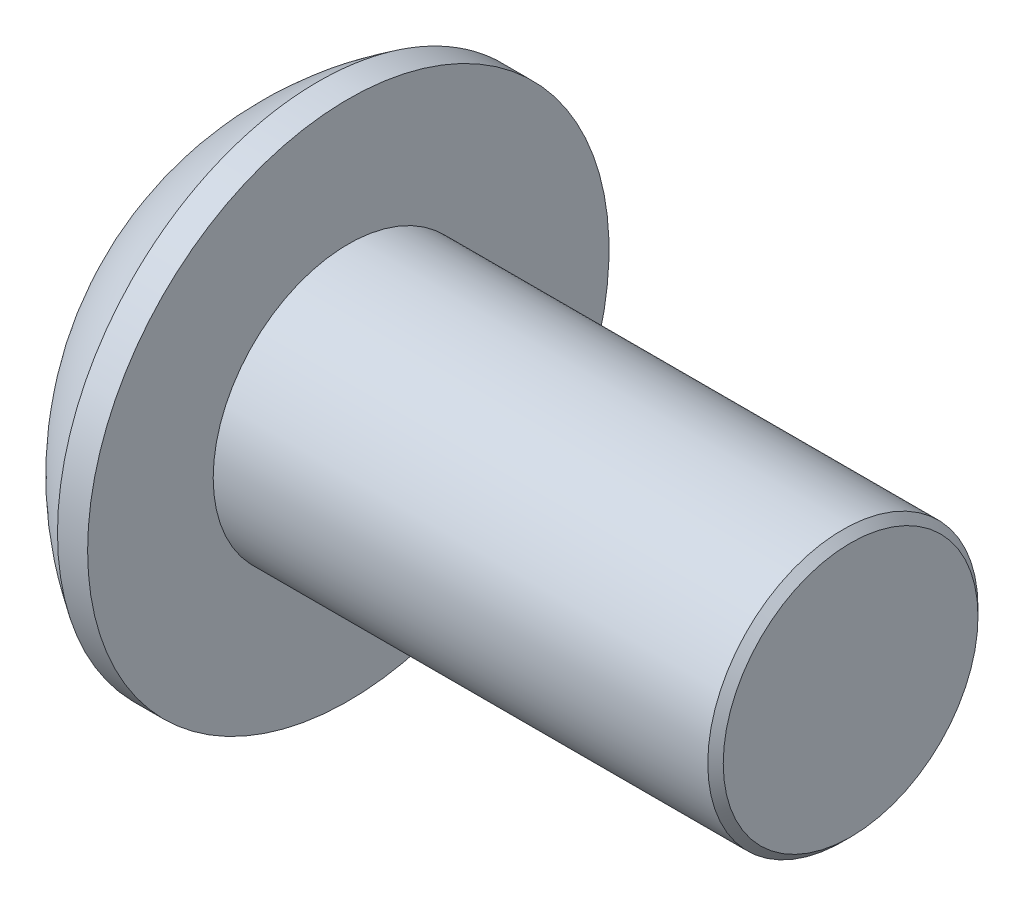
ISO-10303-21;
HEADER;
FILE_DESCRIPTION(('STEP AP214'),'2;1');
FILE_NAME('part.step','',(''),(''),'','','');
FILE_SCHEMA(('AUTOMOTIVE_DESIGN { 1 0 10303 214 1 1 1 1 }'));
ENDSEC;
DATA;
#1=APPLICATION_CONTEXT('core data for automotive mechanical design processes');
#2=APPLICATION_PROTOCOL_DEFINITION('international standard','automotive_design',2000,#1);
#3=PRODUCT_CONTEXT('',#1,'mechanical');
#4=PRODUCT('Part','Part','',(#3));
#5=PRODUCT_RELATED_PRODUCT_CATEGORY('part','',(#4));
#6=PRODUCT_DEFINITION_FORMATION('','',#4);
#7=PRODUCT_DEFINITION_CONTEXT('part definition',#1,'design');
#8=PRODUCT_DEFINITION('design','',#6,#7);
#9=PRODUCT_DEFINITION_SHAPE('','',#8);
#10=(LENGTH_UNIT() NAMED_UNIT(*) SI_UNIT(.MILLI.,.METRE.));
#11=(NAMED_UNIT(*) PLANE_ANGLE_UNIT() SI_UNIT($,.RADIAN.));
#12=(NAMED_UNIT(*) SI_UNIT($,.STERADIAN.) SOLID_ANGLE_UNIT());
#13=UNCERTAINTY_MEASURE_WITH_UNIT(LENGTH_MEASURE(1.E-05),#10,'distance_accuracy_value','');
#14=(GEOMETRIC_REPRESENTATION_CONTEXT(3) GLOBAL_UNCERTAINTY_ASSIGNED_CONTEXT((#13)) GLOBAL_UNIT_ASSIGNED_CONTEXT((#10,
#11,#12)) REPRESENTATION_CONTEXT('',''));
#15=CARTESIAN_POINT('',(0.,0.,0.));
#16=DIRECTION('',(0.,0.,1.));
#17=DIRECTION('',(1.,0.,0.));
#18=AXIS2_PLACEMENT_3D('',#15,#16,#17);
#19=CARTESIAN_POINT('',(1.32080000000034,0.,0.));
#20=DIRECTION('',(-1.,0.,0.));
#21=DIRECTION('',(0.,0.,1.));
#22=AXIS2_PLACEMENT_3D('',#19,#20,#21);
#23=CONICAL_SURFACE('',#22,1.1937999999998,1.04719755119608);
#24=CARTESIAN_POINT('',(2.01004075135902,0.,4.44089209850063E-13));
#25=VERTEX_POINT('',#24);
#26=VERTEX_LOOP('',#25);
#27=FACE_BOUND('',#26,.T.);
#28=CARTESIAN_POINT('',(1.32080000000009,0.,0.));
#29=DIRECTION('',(-1.,0.,0.));
#30=DIRECTION('',(0.,0.,1.));
#31=AXIS2_PLACEMENT_3D('',#28,#29,#30);
#32=CIRCLE('',#31,1.19380000000024);
#33=CARTESIAN_POINT('',(1.32080000000004,0.,1.19380000000012));
#34=VERTEX_POINT('',#33);
#35=CARTESIAN_POINT('',(1.32080000000004,-1.03386112703797,0.596900000000061));
#36=VERTEX_POINT('',#35);
#37=EDGE_CURVE('E19',#34,#36,#32,.F.);
#38=ORIENTED_EDGE('',*,*,#37,.F.);
#39=CARTESIAN_POINT('',(1.32080000000009,0.,0.));
#40=DIRECTION('',(-1.,0.,0.));
#41=DIRECTION('',(0.,0.,1.));
#42=AXIS2_PLACEMENT_3D('',#39,#40,#41);
#43=CIRCLE('',#42,1.19380000000024);
#44=CARTESIAN_POINT('',(1.32080000000004,1.03386112703797,0.596900000000063));
#45=VERTEX_POINT('',#44);
#46=EDGE_CURVE('E89',#45,#34,#43,.F.);
#47=ORIENTED_EDGE('',*,*,#46,.F.);
#48=CARTESIAN_POINT('',(1.32080000000009,0.,0.));
#49=DIRECTION('',(-1.,0.,0.));
#50=DIRECTION('',(0.,0.,1.));
#51=AXIS2_PLACEMENT_3D('',#48,#49,#50);
#52=CIRCLE('',#51,1.19380000000024);
#53=CARTESIAN_POINT('',(1.32080000000004,1.03386112703797,-0.596900000000063));
#54=VERTEX_POINT('',#53);
#55=EDGE_CURVE('E105',#54,#45,#52,.F.);
#56=ORIENTED_EDGE('',*,*,#55,.F.);
#57=CARTESIAN_POINT('',(1.32080000000009,0.,0.));
#58=DIRECTION('',(-1.,0.,0.));
#59=DIRECTION('',(0.,0.,1.));
#60=AXIS2_PLACEMENT_3D('',#57,#58,#59);
#61=CIRCLE('',#60,1.19380000000024);
#62=CARTESIAN_POINT('',(1.32080000000004,1.49420287879031E-12,-1.19380000000012));
#63=VERTEX_POINT('',#62);
#64=EDGE_CURVE('E448',#63,#54,#61,.F.);
#65=ORIENTED_EDGE('',*,*,#64,.F.);
#66=CARTESIAN_POINT('',(1.32080000000009,0.,0.));
#67=DIRECTION('',(-1.,0.,0.));
#68=DIRECTION('',(0.,0.,1.));
#69=AXIS2_PLACEMENT_3D('',#66,#67,#68);
#70=CIRCLE('',#69,1.19380000000024);
#71=CARTESIAN_POINT('',(1.32080000000004,-1.03386112703797,-0.596900000000062));
#72=VERTEX_POINT('',#71);
#73=EDGE_CURVE('E451',#72,#63,#70,.F.);
#74=ORIENTED_EDGE('',*,*,#73,.F.);
#75=CARTESIAN_POINT('',(1.32080000000009,0.,0.));
#76=DIRECTION('',(-1.,0.,0.));
#77=DIRECTION('',(0.,0.,1.));
#78=AXIS2_PLACEMENT_3D('',#75,#76,#77);
#79=CIRCLE('',#78,1.19380000000024);
#80=EDGE_CURVE('E92',#36,#72,#79,.F.);
#81=ORIENTED_EDGE('',*,*,#80,.F.);
#82=EDGE_LOOP('',(#38,#47,#56,#65,#74,#81));
#83=FACE_BOUND('',#82,.T.);
#84=ADVANCED_FACE('F16',(#27,#83),#23,.F.);
#85=CARTESIAN_POINT('',(1.3208,0.,2.3876));
#86=DIRECTION('',(-1.,0.,0.));
#87=DIRECTION('',(0.,0.,1.));
#88=AXIS2_PLACEMENT_3D('',#85,#86,#87);
#89=PLANE('',#88);
#90=DIRECTION('',(0.,1.,0.));
#91=VECTOR('',#90,1.);
#92=CARTESIAN_POINT('',(1.3208,-0.689240751358576,1.1938));
#93=LINE('',#92,#91);
#94=CARTESIAN_POINT('',(1.3208,-0.689240751358576,1.1938));
#95=VERTEX_POINT('',#94);
#96=EDGE_CURVE('E108',#34,#95,#93,.F.);
#97=ORIENTED_EDGE('',*,*,#96,.F.);
#98=ORIENTED_EDGE('',*,*,#37,.T.);
#99=DIRECTION('',(0.,0.5,0.866025403784439));
#100=VECTOR('',#99,1.);
#101=CARTESIAN_POINT('',(1.3208,-1.37848150271715,0.));
#102=LINE('',#101,#100);
#103=EDGE_CURVE('E111',#95,#36,#102,.F.);
#104=ORIENTED_EDGE('',*,*,#103,.F.);
#105=EDGE_LOOP('',(#97,#98,#104));
#106=FACE_BOUND('',#105,.T.);
#107=ADVANCED_FACE('F109',(#106),#89,.T.);
#108=CARTESIAN_POINT('',(1.3208,0.,2.3876));
#109=DIRECTION('',(-1.,0.,0.));
#110=DIRECTION('',(0.,0.,1.));
#111=AXIS2_PLACEMENT_3D('',#108,#109,#110);
#112=PLANE('',#111);
#113=DIRECTION('',(0.,0.5,0.866025403784439));
#114=VECTOR('',#113,1.);
#115=CARTESIAN_POINT('',(1.3208,-1.37848150271715,0.));
#116=LINE('',#115,#114);
#117=CARTESIAN_POINT('',(1.3208,-1.37848150271715,0.));
#118=VERTEX_POINT('',#117);
#119=EDGE_CURVE('E171',#36,#118,#116,.F.);
#120=ORIENTED_EDGE('',*,*,#119,.F.);
#121=ORIENTED_EDGE('',*,*,#80,.T.);
#122=DIRECTION('',(0.,-0.5,0.866025403784439));
#123=VECTOR('',#122,1.);
#124=CARTESIAN_POINT('',(1.3208,-0.689240751358576,-1.1938));
#125=LINE('',#124,#123);
#126=EDGE_CURVE('E159',#118,#72,#125,.F.);
#127=ORIENTED_EDGE('',*,*,#126,.F.);
#128=EDGE_LOOP('',(#120,#121,#127));
#129=FACE_BOUND('',#128,.T.);
#130=ADVANCED_FACE('F248',(#129),#112,.T.);
#131=CARTESIAN_POINT('',(1.3208,0.,2.3876));
#132=DIRECTION('',(-1.,0.,0.));
#133=DIRECTION('',(0.,0.,1.));
#134=AXIS2_PLACEMENT_3D('',#131,#132,#133);
#135=PLANE('',#134);
#136=DIRECTION('',(0.,-0.5,0.866025403784439));
#137=VECTOR('',#136,1.);
#138=CARTESIAN_POINT('',(1.3208,-0.689240751358576,-1.1938));
#139=LINE('',#138,#137);
#140=CARTESIAN_POINT('',(1.3208,-0.689240751358576,-1.1938));
#141=VERTEX_POINT('',#140);
#142=EDGE_CURVE('E156',#72,#141,#139,.F.);
#143=ORIENTED_EDGE('',*,*,#142,.F.);
#144=ORIENTED_EDGE('',*,*,#73,.T.);
#145=DIRECTION('',(0.,-1.,0.));
#146=VECTOR('',#145,1.);
#147=CARTESIAN_POINT('',(1.3208,0.689240751358575,-1.1938));
#148=LINE('',#147,#146);
#149=EDGE_CURVE('E143',#141,#63,#148,.F.);
#150=ORIENTED_EDGE('',*,*,#149,.F.);
#151=EDGE_LOOP('',(#143,#144,#150));
#152=FACE_BOUND('',#151,.T.);
#153=ADVANCED_FACE('F244',(#152),#135,.T.);
#154=CARTESIAN_POINT('',(1.3208,0.,2.3876));
#155=DIRECTION('',(-1.,0.,0.));
#156=DIRECTION('',(0.,0.,1.));
#157=AXIS2_PLACEMENT_3D('',#154,#155,#156);
#158=PLANE('',#157);
#159=DIRECTION('',(0.,-1.,0.));
#160=VECTOR('',#159,1.);
#161=CARTESIAN_POINT('',(1.3208,0.689240751358575,-1.1938));
#162=LINE('',#161,#160);
#163=CARTESIAN_POINT('',(1.3208,0.689240751358575,-1.1938));
#164=VERTEX_POINT('',#163);
#165=EDGE_CURVE('E140',#63,#164,#162,.F.);
#166=ORIENTED_EDGE('',*,*,#165,.F.);
#167=ORIENTED_EDGE('',*,*,#64,.T.);
#168=DIRECTION('',(0.,-0.500000000000001,-0.866025403784438));
#169=VECTOR('',#168,1.);
#170=CARTESIAN_POINT('',(1.3208,1.37848150271715,0.));
#171=LINE('',#170,#169);
#172=EDGE_CURVE('E128',#164,#54,#171,.F.);
#173=ORIENTED_EDGE('',*,*,#172,.F.);
#174=EDGE_LOOP('',(#166,#167,#173));
#175=FACE_BOUND('',#174,.T.);
#176=ADVANCED_FACE('F240',(#175),#158,.T.);
#177=CARTESIAN_POINT('',(1.3208,0.,2.3876));
#178=DIRECTION('',(-1.,0.,0.));
#179=DIRECTION('',(0.,0.,1.));
#180=AXIS2_PLACEMENT_3D('',#177,#178,#179);
#181=PLANE('',#180);
#182=DIRECTION('',(0.,-0.500000000000001,-0.866025403784438));
#183=VECTOR('',#182,1.);
#184=CARTESIAN_POINT('',(1.3208,1.37848150271715,0.));
#185=LINE('',#184,#183);
#186=CARTESIAN_POINT('',(1.3208,1.37848150271715,0.));
#187=VERTEX_POINT('',#186);
#188=EDGE_CURVE('E125',#54,#187,#185,.F.);
#189=ORIENTED_EDGE('',*,*,#188,.F.);
#190=ORIENTED_EDGE('',*,*,#55,.T.);
#191=DIRECTION('',(0.,0.500000000000001,-0.866025403784438));
#192=VECTOR('',#191,1.);
#193=CARTESIAN_POINT('',(1.3208,0.689240751358575,1.1938));
#194=LINE('',#193,#192);
#195=EDGE_CURVE('E148',#187,#45,#194,.F.);
#196=ORIENTED_EDGE('',*,*,#195,.F.);
#197=EDGE_LOOP('',(#189,#190,#196));
#198=FACE_BOUND('',#197,.T.);
#199=ADVANCED_FACE('F237',(#198),#181,.T.);
#200=CARTESIAN_POINT('',(1.3208,0.,2.3876));
#201=DIRECTION('',(-1.,0.,0.));
#202=DIRECTION('',(0.,0.,1.));
#203=AXIS2_PLACEMENT_3D('',#200,#201,#202);
#204=PLANE('',#203);
#205=DIRECTION('',(0.,0.500000000000001,-0.866025403784438));
#206=VECTOR('',#205,1.);
#207=CARTESIAN_POINT('',(1.3208,0.689240751358575,1.1938));
#208=LINE('',#207,#206);
#209=CARTESIAN_POINT('',(1.3208,0.689240751358575,1.1938));
#210=VERTEX_POINT('',#209);
#211=EDGE_CURVE('E103',#45,#210,#208,.F.);
#212=ORIENTED_EDGE('',*,*,#211,.F.);
#213=ORIENTED_EDGE('',*,*,#46,.T.);
#214=DIRECTION('',(0.,1.,0.));
#215=VECTOR('',#214,1.);
#216=CARTESIAN_POINT('',(1.3208,-0.689240751358576,1.1938));
#217=LINE('',#216,#215);
#218=EDGE_CURVE('E100',#210,#34,#217,.F.);
#219=ORIENTED_EDGE('',*,*,#218,.F.);
#220=EDGE_LOOP('',(#212,#213,#219));
#221=FACE_BOUND('',#220,.T.);
#222=ADVANCED_FACE('F98',(#221),#204,.T.);
#223=CARTESIAN_POINT('',(1.3208,-0.689240751358576,1.1938));
#224=DIRECTION('',(0.,0.,-1.));
#225=DIRECTION('',(0.,1.,0.));
#226=AXIS2_PLACEMENT_3D('',#223,#224,#225);
#227=PLANE('',#226);
#228=DIRECTION('',(0.,1.,0.));
#229=VECTOR('',#228,1.);
#230=CARTESIAN_POINT('',(0.,0.,1.1938));
#231=LINE('',#230,#229);
#232=CARTESIAN_POINT('',(0.,0.689240751358575,1.1938));
#233=VERTEX_POINT('',#232);
#234=CARTESIAN_POINT('',(0.,-0.689240751358576,1.1938));
#235=VERTEX_POINT('',#234);
#236=EDGE_CURVE('E132',#233,#235,#231,.F.);
#237=ORIENTED_EDGE('',*,*,#236,.F.);
#238=DIRECTION('',(1.,0.,0.));
#239=VECTOR('',#238,1.);
#240=CARTESIAN_POINT('',(1.3208,0.689240751358575,1.1938));
#241=LINE('',#240,#239);
#242=EDGE_CURVE('E117',#210,#233,#241,.F.);
#243=ORIENTED_EDGE('',*,*,#242,.F.);
#244=ORIENTED_EDGE('',*,*,#218,.T.);
#245=ORIENTED_EDGE('',*,*,#96,.T.);
#246=DIRECTION('',(1.,0.,0.));
#247=VECTOR('',#246,1.);
#248=CARTESIAN_POINT('',(1.3208,-0.689240751358576,1.1938));
#249=LINE('',#248,#247);
#250=EDGE_CURVE('E168',#235,#95,#249,.T.);
#251=ORIENTED_EDGE('',*,*,#250,.F.);
#252=EDGE_LOOP('',(#237,#243,#244,#245,#251));
#253=FACE_BOUND('',#252,.T.);
#254=ADVANCED_FACE('F115',(#253),#227,.T.);
#255=CARTESIAN_POINT('',(1.3208,-1.37848150271715,0.));
#256=DIRECTION('',(0.,0.866025403784439,-0.5));
#257=DIRECTION('',(0.,0.5,0.866025403784439));
#258=AXIS2_PLACEMENT_3D('',#255,#256,#257);
#259=PLANE('',#258);
#260=DIRECTION('',(0.,-0.5,-0.866025403784439));
#261=VECTOR('',#260,1.);
#262=CARTESIAN_POINT('',(0.,-0.689240751358576,1.1938));
#263=LINE('',#262,#261);
#264=CARTESIAN_POINT('',(0.,-1.37848150271715,0.));
#265=VERTEX_POINT('',#264);
#266=EDGE_CURVE('E435',#235,#265,#263,.T.);
#267=ORIENTED_EDGE('',*,*,#266,.F.);
#268=ORIENTED_EDGE('',*,*,#250,.T.);
#269=ORIENTED_EDGE('',*,*,#103,.T.);
#270=ORIENTED_EDGE('',*,*,#119,.T.);
#271=DIRECTION('',(1.,0.,0.));
#272=VECTOR('',#271,1.);
#273=CARTESIAN_POINT('',(1.3208,-1.37848150271715,0.));
#274=LINE('',#273,#272);
#275=EDGE_CURVE('E153',#265,#118,#274,.T.);
#276=ORIENTED_EDGE('',*,*,#275,.F.);
#277=EDGE_LOOP('',(#267,#268,#269,#270,#276));
#278=FACE_BOUND('',#277,.T.);
#279=ADVANCED_FACE('F228',(#278),#259,.T.);
#280=CARTESIAN_POINT('',(1.3208,-0.689240751358576,-1.1938));
#281=DIRECTION('',(0.,0.866025403784439,0.5));
#282=DIRECTION('',(0.,-0.5,0.866025403784439));
#283=AXIS2_PLACEMENT_3D('',#280,#281,#282);
#284=PLANE('',#283);
#285=DIRECTION('',(0.,0.5,-0.866025403784439));
#286=VECTOR('',#285,1.);
#287=CARTESIAN_POINT('',(0.,-1.37848150271715,0.));
#288=LINE('',#287,#286);
#289=CARTESIAN_POINT('',(0.,-0.689240751358576,-1.1938));
#290=VERTEX_POINT('',#289);
#291=EDGE_CURVE('E432',#265,#290,#288,.T.);
#292=ORIENTED_EDGE('',*,*,#291,.F.);
#293=ORIENTED_EDGE('',*,*,#275,.T.);
#294=ORIENTED_EDGE('',*,*,#126,.T.);
#295=ORIENTED_EDGE('',*,*,#142,.T.);
#296=DIRECTION('',(1.,0.,0.));
#297=VECTOR('',#296,1.);
#298=CARTESIAN_POINT('',(1.3208,-0.689240751358576,-1.1938));
#299=LINE('',#298,#297);
#300=EDGE_CURVE('E137',#290,#141,#299,.T.);
#301=ORIENTED_EDGE('',*,*,#300,.F.);
#302=EDGE_LOOP('',(#292,#293,#294,#295,#301));
#303=FACE_BOUND('',#302,.T.);
#304=ADVANCED_FACE('F224',(#303),#284,.T.);
#305=CARTESIAN_POINT('',(1.3208,0.689240751358575,-1.1938));
#306=DIRECTION('',(0.,0.,1.));
#307=DIRECTION('',(0.,-1.,0.));
#308=AXIS2_PLACEMENT_3D('',#305,#306,#307);
#309=PLANE('',#308);
#310=DIRECTION('',(0.,1.,0.));
#311=VECTOR('',#310,1.);
#312=CARTESIAN_POINT('',(0.,0.,-1.1938));
#313=LINE('',#312,#311);
#314=CARTESIAN_POINT('',(0.,0.689240751358575,-1.1938));
#315=VERTEX_POINT('',#314);
#316=EDGE_CURVE('E429',#290,#315,#313,.T.);
#317=ORIENTED_EDGE('',*,*,#316,.F.);
#318=ORIENTED_EDGE('',*,*,#300,.T.);
#319=ORIENTED_EDGE('',*,*,#149,.T.);
#320=ORIENTED_EDGE('',*,*,#165,.T.);
#321=DIRECTION('',(1.,0.,0.));
#322=VECTOR('',#321,1.);
#323=CARTESIAN_POINT('',(1.3208,0.689240751358575,-1.1938));
#324=LINE('',#323,#322);
#325=EDGE_CURVE('E127',#315,#164,#324,.T.);
#326=ORIENTED_EDGE('',*,*,#325,.F.);
#327=EDGE_LOOP('',(#317,#318,#319,#320,#326));
#328=FACE_BOUND('',#327,.T.);
#329=ADVANCED_FACE('F221',(#328),#309,.T.);
#330=CARTESIAN_POINT('',(1.3208,1.37848150271715,0.));
#331=DIRECTION('',(0.,-0.866025403784438,0.500000000000001));
#332=DIRECTION('',(0.,-0.500000000000001,-0.866025403784438));
#333=AXIS2_PLACEMENT_3D('',#330,#331,#332);
#334=PLANE('',#333);
#335=DIRECTION('',(0.,0.500000000000001,0.866025403784438));
#336=VECTOR('',#335,1.);
#337=CARTESIAN_POINT('',(0.,0.689240751358575,-1.1938));
#338=LINE('',#337,#336);
#339=CARTESIAN_POINT('',(0.,1.37848150271715,0.));
#340=VERTEX_POINT('',#339);
#341=EDGE_CURVE('E426',#315,#340,#338,.T.);
#342=ORIENTED_EDGE('',*,*,#341,.F.);
#343=ORIENTED_EDGE('',*,*,#325,.T.);
#344=ORIENTED_EDGE('',*,*,#172,.T.);
#345=ORIENTED_EDGE('',*,*,#188,.T.);
#346=DIRECTION('',(1.,0.,0.));
#347=VECTOR('',#346,1.);
#348=CARTESIAN_POINT('',(1.3208,1.37848150271715,0.));
#349=LINE('',#348,#347);
#350=EDGE_CURVE('E34',#340,#187,#349,.T.);
#351=ORIENTED_EDGE('',*,*,#350,.F.);
#352=EDGE_LOOP('',(#342,#343,#344,#345,#351));
#353=FACE_BOUND('',#352,.T.);
#354=ADVANCED_FACE('F217',(#353),#334,.T.);
#355=CARTESIAN_POINT('',(1.3208,0.689240751358575,1.1938));
#356=DIRECTION('',(0.,-0.866025403784438,-0.500000000000001));
#357=DIRECTION('',(0.,0.500000000000001,-0.866025403784438));
#358=AXIS2_PLACEMENT_3D('',#355,#356,#357);
#359=PLANE('',#358);
#360=DIRECTION('',(0.,-0.500000000000001,0.866025403784438));
#361=VECTOR('',#360,1.);
#362=CARTESIAN_POINT('',(0.,1.37848150271715,0.));
#363=LINE('',#362,#361);
#364=EDGE_CURVE('E203',#340,#233,#363,.T.);
#365=ORIENTED_EDGE('',*,*,#364,.F.);
#366=ORIENTED_EDGE('',*,*,#350,.T.);
#367=ORIENTED_EDGE('',*,*,#195,.T.);
#368=ORIENTED_EDGE('',*,*,#211,.T.);
#369=ORIENTED_EDGE('',*,*,#242,.T.);
#370=EDGE_LOOP('',(#365,#366,#367,#368,#369));
#371=FACE_BOUND('',#370,.T.);
#372=ADVANCED_FACE('F213',(#371),#359,.T.);
#373=CARTESIAN_POINT('',(0.,0.,0.));
#374=DIRECTION('',(-1.,0.,0.));
#375=DIRECTION('',(0.,0.,1.));
#376=AXIS2_PLACEMENT_3D('',#373,#374,#375);
#377=PLANE('',#376);
#378=ORIENTED_EDGE('',*,*,#341,.T.);
#379=ORIENTED_EDGE('',*,*,#364,.T.);
#380=ORIENTED_EDGE('',*,*,#236,.T.);
#381=ORIENTED_EDGE('',*,*,#266,.T.);
#382=ORIENTED_EDGE('',*,*,#291,.T.);
#383=ORIENTED_EDGE('',*,*,#316,.T.);
#384=EDGE_LOOP('',(#378,#379,#380,#381,#382,#383));
#385=FACE_BOUND('',#384,.T.);
#386=CARTESIAN_POINT('',(0.,1.647825,0.));
#387=CARTESIAN_POINT('',(1.6308873576372E-13,1.64781976319874,0.0924902039777533));
#388=CARTESIAN_POINT('',(1.32723456051501E-13,1.63999511633709,0.185145014326371));
#389=CARTESIAN_POINT('',(0.,1.6167119250047,0.322075808080014));
#390=CARTESIAN_POINT('',(-1.58307829769064E-13,1.60700618770234,0.367435533396361));
#391=CARTESIAN_POINT('',(1.5887042259766E-13,1.58380101865853,0.457220935695141));
#392=CARTESIAN_POINT('',(5.68553662672778E-13,1.5702985083103,0.501645823115265));
#393=CARTESIAN_POINT('',(9.36169533411239E-13,1.52428156574313,0.632817459278969));
#394=CARTESIAN_POINT('',(0.,1.48621992666366,0.717681965518645));
#395=CARTESIAN_POINT('',(0.,1.39637079695658,0.879809706624018));
#396=CARTESIAN_POINT('',(7.82226199304679E-13,1.34458278455109,0.957072652379997));
#397=CARTESIAN_POINT('',(4.86961747456247E-13,1.25777784714521,1.06558770210238));
#398=CARTESIAN_POINT('',(1.3347006403413E-13,1.22729946114794,1.10054993332365));
#399=CARTESIAN_POINT('',(-1.32907906987598E-13,1.16354004969106,1.16775237388222));
#400=CARTESIAN_POINT('',(0.,1.13026175473033,1.19999517515816));
#401=CARTESIAN_POINT('',(0.,1.02649304340867,1.29236218866442));
#402=CARTESIAN_POINT('',(0.,0.952049986714078,1.34814848277713));
#403=CARTESIAN_POINT('',(0.,0.794895196754069,1.44639825105766));
#404=CARTESIAN_POINT('',(0.,0.712183775431296,1.48886222758992));
#405=CARTESIAN_POINT('',(0.,0.540796624265729,1.55930919813143));
#406=CARTESIAN_POINT('',(0.,0.452120958135285,1.58729234680269));
#407=CARTESIAN_POINT('',(0.,0.271332331080316,1.62797191307414));
#408=CARTESIAN_POINT('',(0.,0.179219351801787,1.64066824903626));
#409=CARTESIAN_POINT('',(0.,-0.00583077027841068,1.65041748705409));
#410=CARTESIAN_POINT('',(0.,-0.0987679130800802,1.64747038910979));
#411=CARTESIAN_POINT('',(0.,-0.282830196388828,1.62601274134436));
#412=CARTESIAN_POINT('',(0.,-0.373955346570022,1.60750227463795));
#413=CARTESIAN_POINT('',(0.,-0.551796068178808,1.55545413364524));
#414=CARTESIAN_POINT('',(0.,-0.63851159249817,1.52191629885844));
#415=CARTESIAN_POINT('',(0.,-0.805120175533158,1.44072378052347));
#416=CARTESIAN_POINT('',(0.,-0.88501297681996,1.39306856461394));
#417=CARTESIAN_POINT('',(0.,-0.997912879588364,1.31211658756413));
#418=CARTESIAN_POINT('',(0.,-1.0343949246834,1.28354906167735));
#419=CARTESIAN_POINT('',(0.,-1.10486279842069,1.2234182930371));
#420=CARTESIAN_POINT('',(0.,-1.13884618403291,1.19185218578118));
#421=CARTESIAN_POINT('',(0.,-1.23657300939909,1.09305906467359));
#422=CARTESIAN_POINT('',(0.,-1.29619288399357,1.02166556658613));
#423=CARTESIAN_POINT('',(0.,-1.40258050817756,0.869876423478037));
#424=CARTESIAN_POINT('',(0.,-1.44934874627767,0.789481120793482));
#425=CARTESIAN_POINT('',(0.,-1.50889406070376,0.663870959313345));
#426=CARTESIAN_POINT('',(0.,-1.52698985473587,0.621110806760431));
#427=CARTESIAN_POINT('',(0.,-1.55950093966665,0.534260776864335));
#428=CARTESIAN_POINT('',(-1.05039697618021E-13,-1.57391920916439,0.490172008203172));
#429=CARTESIAN_POINT('',(2.10178020665955E-13,-1.6114617790958,0.356445777718599));
#430=CARTESIAN_POINT('',(1.14251859340662E-12,-1.62897899568075,0.265126085962908));
#431=CARTESIAN_POINT('',(4.34048914238184E-13,-1.6417434721491,0.144386595969389));
#432=CARTESIAN_POINT('',(1.2133871111091E-13,-1.64402207668917,0.115560405797876));
#433=CARTESIAN_POINT('',(-1.2090503024199E-13,-1.64706365940122,0.0578281757252701));
#434=CARTESIAN_POINT('',(0.,-1.64782663757319,0.0289221358241782));
#435=CARTESIAN_POINT('',(1.64938783669285E-13,-1.64781976319875,-0.0924902039777538));
#436=CARTESIAN_POINT('',(1.33063346980503E-13,-1.63999511633711,-0.18514501432637));
#437=CARTESIAN_POINT('',(0.,-1.61671192500471,-0.322075808080014));
#438=CARTESIAN_POINT('',(-1.58354507530811E-13,-1.60700618770236,-0.367435533396362));
#439=CARTESIAN_POINT('',(1.58917138317674E-13,-1.58380101865854,-0.457220935695141));
#440=CARTESIAN_POINT('',(5.68569932116631E-13,-1.57029850831032,-0.501645823115264));
#441=CARTESIAN_POINT('',(9.36137072078051E-13,-1.52428156574314,-0.632817459278968));
#442=CARTESIAN_POINT('',(0.,-1.48621992666367,-0.717681965518645));
#443=CARTESIAN_POINT('',(0.,-1.3963707969566,-0.879809706624018));
#444=CARTESIAN_POINT('',(7.8222767876737E-13,-1.34458278455111,-0.957072652379997));
#445=CARTESIAN_POINT('',(4.86961006755577E-13,-1.25777784714523,-1.06558770210238));
#446=CARTESIAN_POINT('',(1.33469967938541E-13,-1.22729946114795,-1.10054993332365));
#447=CARTESIAN_POINT('',(-1.32907810984659E-13,-1.16354004969108,-1.16775237388222));
#448=CARTESIAN_POINT('',(0.,-1.13026175473034,-1.19999517515816));
#449=CARTESIAN_POINT('',(0.,-1.02649304340868,-1.29236218866442));
#450=CARTESIAN_POINT('',(0.,-0.952049986714093,-1.34814848277713));
#451=CARTESIAN_POINT('',(0.,-0.794895196754083,-1.44639825105766));
#452=CARTESIAN_POINT('',(0.,-0.71218377543131,-1.48886222758992));
#453=CARTESIAN_POINT('',(0.,-0.540796624265743,-1.55930919813143));
#454=CARTESIAN_POINT('',(0.,-0.452120958135299,-1.58729234680269));
#455=CARTESIAN_POINT('',(0.,-0.27133233108033,-1.62797191307414));
#456=CARTESIAN_POINT('',(0.,-0.179219351801801,-1.64066824903626));
#457=CARTESIAN_POINT('',(0.,0.00583077027839649,-1.65041748705409));
#458=CARTESIAN_POINT('',(0.,0.0987679130800661,-1.64747038910979));
#459=CARTESIAN_POINT('',(0.,0.282830196388813,-1.62601274134436));
#460=CARTESIAN_POINT('',(0.,0.373955346570007,-1.60750227463795));
#461=CARTESIAN_POINT('',(0.,0.551796068178793,-1.55545413364524));
#462=CARTESIAN_POINT('',(0.,0.638511592498156,-1.52191629885844));
#463=CARTESIAN_POINT('',(0.,0.805120175533144,-1.44072378052347));
#464=CARTESIAN_POINT('',(0.,0.885012976819946,-1.39306856461394));
#465=CARTESIAN_POINT('',(0.,0.99791287958835,-1.31211658756413));
#466=CARTESIAN_POINT('',(0.,1.03439492468339,-1.28354906167735));
#467=CARTESIAN_POINT('',(0.,1.10486279842068,-1.2234182930371));
#468=CARTESIAN_POINT('',(0.,1.1388461840329,-1.19185218578118));
#469=CARTESIAN_POINT('',(0.,1.23657300939908,-1.09305906467359));
#470=CARTESIAN_POINT('',(0.,1.29619288399356,-1.02166556658613));
#471=CARTESIAN_POINT('',(0.,1.40258050817755,-0.869876423478036));
#472=CARTESIAN_POINT('',(0.,1.44934874627766,-0.789481120793482));
#473=CARTESIAN_POINT('',(0.,1.50889406070375,-0.663870959313345));
#474=CARTESIAN_POINT('',(0.,1.52698985473586,-0.621110806760431));
#475=CARTESIAN_POINT('',(0.,1.55950093966663,-0.534260776864334));
#476=CARTESIAN_POINT('',(-1.04953536136957E-13,1.57391920916437,-0.490172008203171));
#477=CARTESIAN_POINT('',(2.10006149477814E-13,1.61146177909579,-0.356445777718599));
#478=CARTESIAN_POINT('',(1.14225956750636E-12,1.62897899568074,-0.265126085962908));
#479=CARTESIAN_POINT('',(4.34129912894769E-13,1.64174347214908,-0.144386595969389));
#480=CARTESIAN_POINT('',(1.21534559462057E-13,1.64402207668915,-0.115560405797875));
#481=CARTESIAN_POINT('',(-1.21100878593138E-13,1.6470636594012,-0.0578281757252705));
#482=CARTESIAN_POINT('',(0.,1.64782663757318,-0.0289221358241788));
#483=CARTESIAN_POINT('',(0.,1.647825,0.));
#484=B_SPLINE_CURVE_WITH_KNOTS('',3,(#386,#387,#388,#389,#390,#391,#392,#393,#394,#395,#396,
#397,#398,#399,#400,#401,#402,#403,#404,#405,#406,#407,#408,#409,#410,#411,#412,#413,#414,#415,
#416,#417,#418,#419,#420,#421,#422,#423,#424,#425,#426,#427,#428,#429,#430,#431,#432,#433,#434,
#435,#436,#437,#438,#439,#440,#441,#442,#443,#444,#445,#446,#447,#448,#449,#450,#451,#452,#453,
#454,#455,#456,#457,#458,#459,#460,#461,#462,#463,#464,#465,#466,#467,#468,#469,#470,#471,#472,
#473,#474,#475,#476,#477,#478,#479,#480,#481,#482,#483),.UNSPECIFIED.,.T.,.F.,(4,2,2,2,2,2,2,2,
2,2,2,2,2,2,2,2,2,2,2,2,2,2,2,2,2,2,2,2,2,2,2,2,2,2,2,2,2,2,2,2,2,2,2,2,2,2,2,2,4),(0.,
0.277336029422427,0.416368541537112,0.555514114625601,0.833141970294989,1.11078038089036,
1.24978149120748,1.38864858351854,1.66629367015056,1.94392828594775,2.22155993641642,
2.49919306954938,2.77682620268235,3.05445785315102,3.33209246894821,3.60973755557991,
3.74860464789075,3.88760575820768,4.16524416880334,4.44287202447289,4.58201759756162,
4.72105010967663,4.99838613909884,5.08511046196679,5.17183478483479,5.44917081425721,
5.5882033263719,5.72734889946039,6.00497675512977,6.28261516572515,6.42161627604227,
6.56048336835333,6.83812845498535,7.11576307078254,7.39339472125121,7.67102785438416,
7.94866098751713,8.22629263798581,8.503927253783,8.7815723404147,8.92043943272554,
9.05944054304247,9.33707895363812,9.61470680930768,9.75385238239641,9.89288489451142,
10.1702209239336,10.2569452468016,10.3436695696696),.UNSPECIFIED.);
#485=CARTESIAN_POINT('',(0.,1.647825,0.));
#486=VERTEX_POINT('',#485);
#487=EDGE_CURVE('E197',#486,#486,#484,.T.);
#488=ORIENTED_EDGE('',*,*,#487,.F.);
#489=EDGE_LOOP('',(#488));
#490=FACE_BOUND('',#489,.T.);
#491=ADVANCED_FACE('F209',(#385,#490),#377,.T.);
#492=CARTESIAN_POINT('',(3.5013236260776,0.,0.));
#493=DIRECTION('',(0.,1.,0.));
#494=DIRECTION('',(1.,0.,0.));
#495=AXIS2_PLACEMENT_3D('',#492,#493,#494);
#496=SPHERICAL_SURFACE('',#495,3.86970210289554);
#497=CARTESIAN_POINT('',(1.4732,0.,0.));
#498=DIRECTION('',(-1.,0.,0.));
#499=DIRECTION('',(0.,0.,1.));
#500=AXIS2_PLACEMENT_3D('',#497,#498,#499);
#501=CIRCLE('',#500,3.29565);
#502=CARTESIAN_POINT('',(1.4732,0.,3.29565));
#503=VERTEX_POINT('',#502);
#504=EDGE_CURVE('E194',#503,#503,#501,.F.);
#505=ORIENTED_EDGE('',*,*,#504,.F.);
#506=EDGE_LOOP('',(#505));
#507=FACE_BOUND('',#506,.T.);
#508=ORIENTED_EDGE('',*,*,#487,.T.);
#509=EDGE_LOOP('',(#508));
#510=FACE_BOUND('',#509,.T.);
#511=ADVANCED_FACE('F205',(#507,#510),#496,.T.);
#512=CARTESIAN_POINT('',(8.2042,0.,0.));
#513=DIRECTION('',(-1.,0.,0.));
#514=DIRECTION('',(0.,0.,1.));
#515=AXIS2_PLACEMENT_3D('',#512,#513,#514);
#516=PLANE('',#515);
#517=CARTESIAN_POINT('',(8.20419999996602,0.,0.));
#518=DIRECTION('',(-1.,0.,0.));
#519=DIRECTION('',(0.,0.,1.));
#520=AXIS2_PLACEMENT_3D('',#517,#518,#519);
#521=CIRCLE('',#520,1.61035999997239);
#522=CARTESIAN_POINT('',(8.20419999996602,0.,1.61035999997239));
#523=VERTEX_POINT('',#522);
#524=EDGE_CURVE('E191',#523,#523,#521,.T.);
#525=ORIENTED_EDGE('',*,*,#524,.F.);
#526=EDGE_LOOP('',(#525));
#527=FACE_BOUND('',#526,.T.);
#528=ADVANCED_FACE('F277',(#527),#516,.F.);
#529=CARTESIAN_POINT('',(0.,0.,0.));
#530=DIRECTION('',(-1.,0.,0.));
#531=DIRECTION('',(0.,0.,1.));
#532=AXIS2_PLACEMENT_3D('',#529,#530,#531);
#533=CYLINDRICAL_SURFACE('',#532,3.29565);
#534=ORIENTED_EDGE('',*,*,#504,.T.);
#535=EDGE_LOOP('',(#534));
#536=FACE_BOUND('',#535,.T.);
#537=CARTESIAN_POINT('',(1.8542,0.,0.));
#538=DIRECTION('',(-1.,0.,0.));
#539=DIRECTION('',(0.,0.,1.));
#540=AXIS2_PLACEMENT_3D('',#537,#538,#539);
#541=CIRCLE('',#540,3.29565);
#542=CARTESIAN_POINT('',(1.8542,0.,3.29565));
#543=VERTEX_POINT('',#542);
#544=EDGE_CURVE('E188',#543,#543,#541,.T.);
#545=ORIENTED_EDGE('',*,*,#544,.T.);
#546=EDGE_LOOP('',(#545));
#547=FACE_BOUND('',#546,.T.);
#548=ADVANCED_FACE('F274',(#536,#547),#533,.T.);
#549=CARTESIAN_POINT('',(8.10641000009582,0.,0.));
#550=DIRECTION('',(-1.,0.,0.));
#551=DIRECTION('',(0.,0.,1.));
#552=AXIS2_PLACEMENT_3D('',#549,#550,#551);
#553=CONICAL_SURFACE('',#552,1.70814999989943,0.785398163688089);
#554=CARTESIAN_POINT('',(8.10641000000003,0.,0.));
#555=DIRECTION('',(-1.,0.,0.));
#556=DIRECTION('',(0.,0.,1.));
#557=AXIS2_PLACEMENT_3D('',#554,#555,#556);
#558=CIRCLE('',#557,1.70814999999999);
#559=CARTESIAN_POINT('',(8.10641000000003,0.,1.70814999999999));
#560=VERTEX_POINT('',#559);
#561=EDGE_CURVE('E25',#560,#560,#558,.T.);
#562=ORIENTED_EDGE('',*,*,#561,.F.);
#563=EDGE_LOOP('',(#562));
#564=FACE_BOUND('',#563,.T.);
#565=ORIENTED_EDGE('',*,*,#524,.T.);
#566=EDGE_LOOP('',(#565));
#567=FACE_BOUND('',#566,.T.);
#568=ADVANCED_FACE('F267',(#564,#567),#553,.T.);
#569=CARTESIAN_POINT('',(1.8542,1.70814999999999,0.));
#570=DIRECTION('',(-1.,0.,0.));
#571=DIRECTION('',(0.,0.,1.));
#572=AXIS2_PLACEMENT_3D('',#569,#570,#571);
#573=PLANE('',#572);
#574=CARTESIAN_POINT('',(1.8542,0.,0.));
#575=DIRECTION('',(-1.,0.,0.));
#576=DIRECTION('',(0.,0.,1.));
#577=AXIS2_PLACEMENT_3D('',#574,#575,#576);
#578=CIRCLE('',#577,1.70814999999999);
#579=CARTESIAN_POINT('',(1.8542,0.,1.70814999999999));
#580=VERTEX_POINT('',#579);
#581=EDGE_CURVE('E11',#580,#580,#578,.F.);
#582=ORIENTED_EDGE('',*,*,#581,.F.);
#583=EDGE_LOOP('',(#582));
#584=FACE_BOUND('',#583,.T.);
#585=ORIENTED_EDGE('',*,*,#544,.F.);
#586=EDGE_LOOP('',(#585));
#587=FACE_BOUND('',#586,.T.);
#588=ADVANCED_FACE('F261',(#584,#587),#573,.F.);
#589=CARTESIAN_POINT('',(0.,0.,0.));
#590=DIRECTION('',(-1.,0.,0.));
#591=DIRECTION('',(0.,0.,1.));
#592=AXIS2_PLACEMENT_3D('',#589,#590,#591);
#593=CYLINDRICAL_SURFACE('',#592,1.70814999999999);
#594=ORIENTED_EDGE('',*,*,#581,.T.);
#595=EDGE_LOOP('',(#594));
#596=FACE_BOUND('',#595,.T.);
#597=ORIENTED_EDGE('',*,*,#561,.T.);
#598=EDGE_LOOP('',(#597));
#599=FACE_BOUND('',#598,.T.);
#600=ADVANCED_FACE('F259',(#596,#599),#593,.T.);
#601=CLOSED_SHELL('',(#84,#107,#130,#153,#176,#199,#222,#254,#279,#304,#329,#354,#372,#491,#511,
#528,#548,#568,#588,#600));
#602=MANIFOLD_SOLID_BREP('B1',#601);
#603=ADVANCED_BREP_SHAPE_REPRESENTATION('',(#18,#602),#14);
#604=SHAPE_DEFINITION_REPRESENTATION(#9,#603);
ENDSEC;
END-ISO-10303-21;
